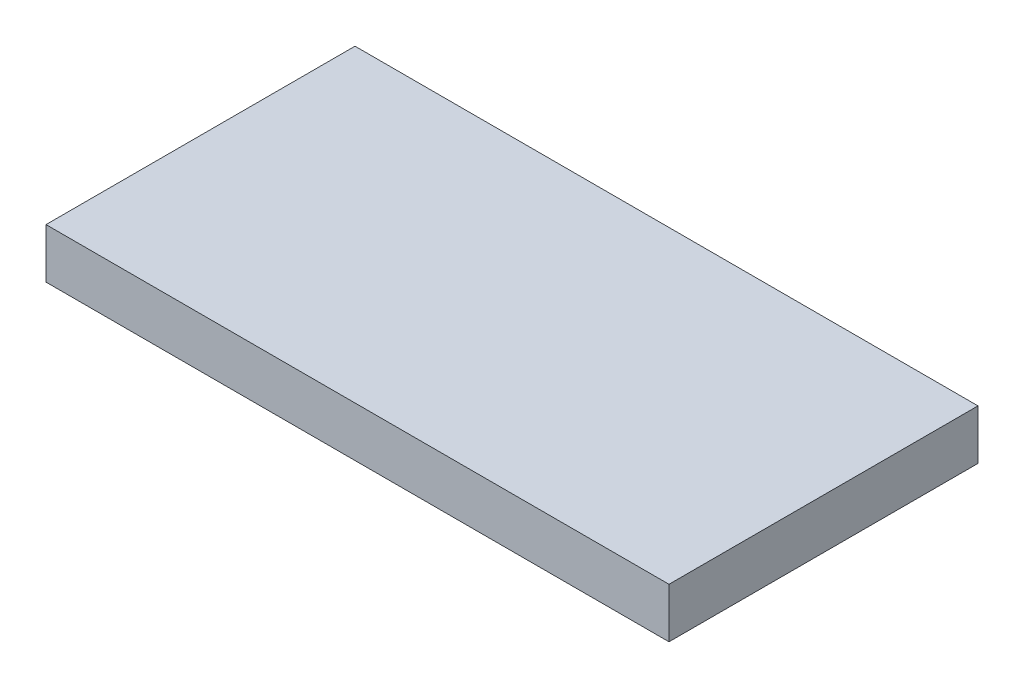
ISO-10303-21;
HEADER;
FILE_DESCRIPTION(('STEP AP214'),'2;1');
FILE_NAME('part.step','',(''),(''),'','','');
FILE_SCHEMA(('AUTOMOTIVE_DESIGN { 1 0 10303 214 1 1 1 1 }'));
ENDSEC;
DATA;
#1=APPLICATION_CONTEXT('core data for automotive mechanical design processes');
#2=APPLICATION_PROTOCOL_DEFINITION('international standard','automotive_design',2000,#1);
#3=PRODUCT_CONTEXT('',#1,'mechanical');
#4=PRODUCT('Part','Part','',(#3));
#5=PRODUCT_RELATED_PRODUCT_CATEGORY('part','',(#4));
#6=PRODUCT_DEFINITION_FORMATION('','',#4);
#7=PRODUCT_DEFINITION_CONTEXT('part definition',#1,'design');
#8=PRODUCT_DEFINITION('design','',#6,#7);
#9=PRODUCT_DEFINITION_SHAPE('','',#8);
#10=(LENGTH_UNIT() NAMED_UNIT(*) SI_UNIT(.MILLI.,.METRE.));
#11=(NAMED_UNIT(*) PLANE_ANGLE_UNIT() SI_UNIT($,.RADIAN.));
#12=(NAMED_UNIT(*) SI_UNIT($,.STERADIAN.) SOLID_ANGLE_UNIT());
#13=UNCERTAINTY_MEASURE_WITH_UNIT(LENGTH_MEASURE(1.E-05),#10,'distance_accuracy_value','');
#14=(GEOMETRIC_REPRESENTATION_CONTEXT(3) GLOBAL_UNCERTAINTY_ASSIGNED_CONTEXT((#13)) GLOBAL_UNIT_ASSIGNED_CONTEXT((#10,
#11,#12)) REPRESENTATION_CONTEXT('',''));
#15=CARTESIAN_POINT('',(0.,0.,0.));
#16=DIRECTION('',(0.,0.,1.));
#17=DIRECTION('',(1.,0.,0.));
#18=AXIS2_PLACEMENT_3D('',#15,#16,#17);
#19=CARTESIAN_POINT('',(12.5538862382831,38.4864983767566,241.577881707232));
#20=DIRECTION('',(0.,1.,0.));
#21=DIRECTION('',(0.,0.,1.));
#22=AXIS2_PLACEMENT_3D('',#19,#20,#21);
#23=PLANE('',#22);
#24=DIRECTION('',(0.,0.,-1.));
#25=VECTOR('',#24,1.);
#26=CARTESIAN_POINT('',(10.9663862382831,38.4864983767566,240.790481707232));
#27=LINE('',#26,#25);
#28=CARTESIAN_POINT('',(10.9663862382831,38.4864983767566,242.365281707232));
#29=VERTEX_POINT('',#28);
#30=CARTESIAN_POINT('',(10.9663862382831,38.4864983767566,240.790481707232));
#31=VERTEX_POINT('',#30);
#32=EDGE_CURVE('E20',#29,#31,#27,.T.);
#33=ORIENTED_EDGE('',*,*,#32,.T.);
#34=DIRECTION('',(1.,0.,0.));
#35=VECTOR('',#34,1.);
#36=CARTESIAN_POINT('',(10.9663862382831,38.4864983767566,240.790481707232));
#37=LINE('',#36,#35);
#38=CARTESIAN_POINT('',(14.1413862382831,38.4864983767566,240.790481707232));
#39=VERTEX_POINT('',#38);
#40=EDGE_CURVE('E87',#31,#39,#37,.T.);
#41=ORIENTED_EDGE('',*,*,#40,.T.);
#42=DIRECTION('',(0.,0.,1.));
#43=VECTOR('',#42,1.);
#44=CARTESIAN_POINT('',(14.1413862382831,38.4864983767566,240.790481707232));
#45=LINE('',#44,#43);
#46=CARTESIAN_POINT('',(14.1413862382831,38.4864983767566,242.365281707232));
#47=VERTEX_POINT('',#46);
#48=EDGE_CURVE('E56',#39,#47,#45,.T.);
#49=ORIENTED_EDGE('',*,*,#48,.T.);
#50=DIRECTION('',(-1.,0.,0.));
#51=VECTOR('',#50,1.);
#52=CARTESIAN_POINT('',(10.9663862382831,38.4864983767566,242.365281707232));
#53=LINE('',#52,#51);
#54=EDGE_CURVE('E58',#47,#29,#53,.T.);
#55=ORIENTED_EDGE('',*,*,#54,.T.);
#56=EDGE_LOOP('',(#33,#41,#49,#55));
#57=FACE_BOUND('',#56,.T.);
#58=ADVANCED_FACE('F17',(#57),#23,.F.);
#59=CARTESIAN_POINT('',(10.9663862382831,38.7404983767566,240.790481707232));
#60=DIRECTION('',(1.,0.,0.));
#61=DIRECTION('',(0.,0.,-1.));
#62=AXIS2_PLACEMENT_3D('',#59,#60,#61);
#63=PLANE('',#62);
#64=DIRECTION('',(0.,0.,1.));
#65=VECTOR('',#64,1.);
#66=CARTESIAN_POINT('',(10.9663862382831,38.7404983767566,241.577881707232));
#67=LINE('',#66,#65);
#68=CARTESIAN_POINT('',(10.9663862382831,38.7404983767566,240.790481707232));
#69=VERTEX_POINT('',#68);
#70=CARTESIAN_POINT('',(10.9663862382831,38.7404983767566,242.365281707232));
#71=VERTEX_POINT('',#70);
#72=EDGE_CURVE('E93',#69,#71,#67,.T.);
#73=ORIENTED_EDGE('',*,*,#72,.F.);
#74=DIRECTION('',(0.,1.,0.));
#75=VECTOR('',#74,1.);
#76=CARTESIAN_POINT('',(10.9663862382831,38.7404983767566,240.790481707232));
#77=LINE('',#76,#75);
#78=EDGE_CURVE('E70',#69,#31,#77,.F.);
#79=ORIENTED_EDGE('',*,*,#78,.T.);
#80=ORIENTED_EDGE('',*,*,#32,.F.);
#81=DIRECTION('',(0.,1.,0.));
#82=VECTOR('',#81,1.);
#83=CARTESIAN_POINT('',(10.9663862382831,38.7404983767566,242.365281707232));
#84=LINE('',#83,#82);
#85=EDGE_CURVE('E65',#29,#71,#84,.T.);
#86=ORIENTED_EDGE('',*,*,#85,.T.);
#87=EDGE_LOOP('',(#73,#79,#80,#86));
#88=FACE_BOUND('',#87,.T.);
#89=ADVANCED_FACE('F67',(#88),#63,.F.);
#90=CARTESIAN_POINT('',(10.9663862382831,38.7404983767566,242.365281707232));
#91=DIRECTION('',(0.,0.,-1.));
#92=DIRECTION('',(-1.,0.,0.));
#93=AXIS2_PLACEMENT_3D('',#90,#91,#92);
#94=PLANE('',#93);
#95=DIRECTION('',(1.,0.,0.));
#96=VECTOR('',#95,1.);
#97=CARTESIAN_POINT('',(12.5538862382831,38.7404983767566,242.365281707232));
#98=LINE('',#97,#96);
#99=CARTESIAN_POINT('',(14.1413862382831,38.7404983767566,242.365281707232));
#100=VERTEX_POINT('',#99);
#101=EDGE_CURVE('E75',#71,#100,#98,.T.);
#102=ORIENTED_EDGE('',*,*,#101,.F.);
#103=ORIENTED_EDGE('',*,*,#85,.F.);
#104=ORIENTED_EDGE('',*,*,#54,.F.);
#105=DIRECTION('',(0.,1.,0.));
#106=VECTOR('',#105,1.);
#107=CARTESIAN_POINT('',(14.1413862382831,38.7404983767566,242.365281707232));
#108=LINE('',#107,#106);
#109=EDGE_CURVE('E82',#47,#100,#108,.T.);
#110=ORIENTED_EDGE('',*,*,#109,.T.);
#111=EDGE_LOOP('',(#102,#103,#104,#110));
#112=FACE_BOUND('',#111,.T.);
#113=ADVANCED_FACE('F73',(#112),#94,.F.);
#114=CARTESIAN_POINT('',(14.1413862382831,38.7404983767566,240.790481707232));
#115=DIRECTION('',(-1.,0.,0.));
#116=DIRECTION('',(0.,0.,1.));
#117=AXIS2_PLACEMENT_3D('',#114,#115,#116);
#118=PLANE('',#117);
#119=DIRECTION('',(0.,0.,1.));
#120=VECTOR('',#119,1.);
#121=CARTESIAN_POINT('',(14.1413862382831,38.7404983767566,241.577881707232));
#122=LINE('',#121,#120);
#123=CARTESIAN_POINT('',(14.1413862382831,38.7404983767566,240.790481707232));
#124=VERTEX_POINT('',#123);
#125=EDGE_CURVE('E27',#100,#124,#122,.F.);
#126=ORIENTED_EDGE('',*,*,#125,.F.);
#127=ORIENTED_EDGE('',*,*,#109,.F.);
#128=ORIENTED_EDGE('',*,*,#48,.F.);
#129=DIRECTION('',(0.,1.,0.));
#130=VECTOR('',#129,1.);
#131=CARTESIAN_POINT('',(14.1413862382831,38.7404983767566,240.790481707232));
#132=LINE('',#131,#130);
#133=EDGE_CURVE('E36',#39,#124,#132,.T.);
#134=ORIENTED_EDGE('',*,*,#133,.T.);
#135=EDGE_LOOP('',(#126,#127,#128,#134));
#136=FACE_BOUND('',#135,.T.);
#137=ADVANCED_FACE('F102',(#136),#118,.F.);
#138=CARTESIAN_POINT('',(10.9663862382831,38.7404983767566,240.790481707232));
#139=DIRECTION('',(0.,0.,1.));
#140=DIRECTION('',(1.,0.,0.));
#141=AXIS2_PLACEMENT_3D('',#138,#139,#140);
#142=PLANE('',#141);
#143=DIRECTION('',(1.,0.,0.));
#144=VECTOR('',#143,1.);
#145=CARTESIAN_POINT('',(12.5538862382831,38.7404983767566,240.790481707232));
#146=LINE('',#145,#144);
#147=EDGE_CURVE('E11',#124,#69,#146,.F.);
#148=ORIENTED_EDGE('',*,*,#147,.F.);
#149=ORIENTED_EDGE('',*,*,#133,.F.);
#150=ORIENTED_EDGE('',*,*,#40,.F.);
#151=ORIENTED_EDGE('',*,*,#78,.F.);
#152=EDGE_LOOP('',(#148,#149,#150,#151));
#153=FACE_BOUND('',#152,.T.);
#154=ADVANCED_FACE('F104',(#153),#142,.F.);
#155=CARTESIAN_POINT('',(12.5538862382831,38.7404983767566,241.577881707232));
#156=DIRECTION('',(0.,1.,0.));
#157=DIRECTION('',(0.,0.,1.));
#158=AXIS2_PLACEMENT_3D('',#155,#156,#157);
#159=PLANE('',#158);
#160=ORIENTED_EDGE('',*,*,#125,.T.);
#161=ORIENTED_EDGE('',*,*,#147,.T.);
#162=ORIENTED_EDGE('',*,*,#72,.T.);
#163=ORIENTED_EDGE('',*,*,#101,.T.);
#164=EDGE_LOOP('',(#160,#161,#162,#163));
#165=FACE_BOUND('',#164,.T.);
#166=ADVANCED_FACE('F101',(#165),#159,.T.);
#167=CLOSED_SHELL('',(#58,#89,#113,#137,#154,#166));
#168=MANIFOLD_SOLID_BREP('B1',#167);
#169=ADVANCED_BREP_SHAPE_REPRESENTATION('',(#18,#168),#14);
#170=SHAPE_DEFINITION_REPRESENTATION(#9,#169);
ENDSEC;
END-ISO-10303-21;
